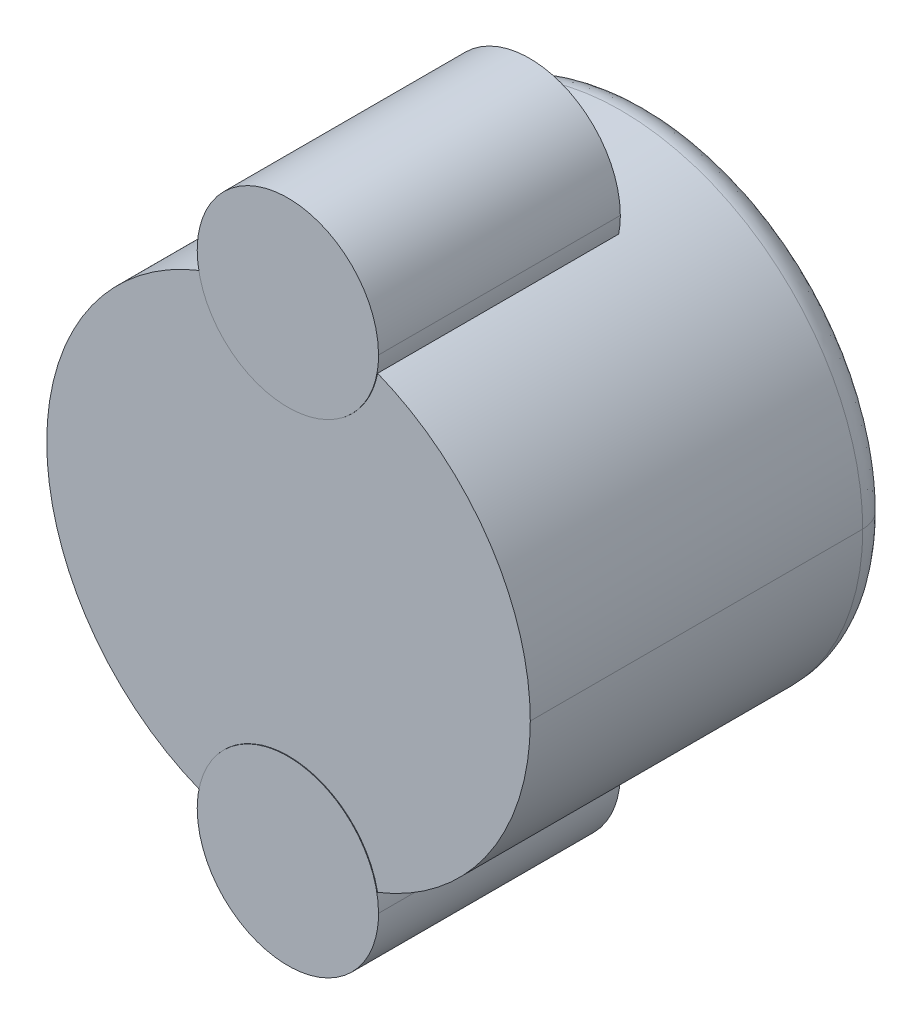
ISO-10303-21;
HEADER;
FILE_DESCRIPTION(('STEP AP214'),'2;1');
FILE_NAME('part.step','',(''),(''),'','','');
FILE_SCHEMA(('AUTOMOTIVE_DESIGN { 1 0 10303 214 1 1 1 1 }'));
ENDSEC;
DATA;
#1=APPLICATION_CONTEXT('core data for automotive mechanical design processes');
#2=APPLICATION_PROTOCOL_DEFINITION('international standard','automotive_design',2000,#1);
#3=PRODUCT_CONTEXT('',#1,'mechanical');
#4=PRODUCT('Part','Part','',(#3));
#5=PRODUCT_RELATED_PRODUCT_CATEGORY('part','',(#4));
#6=PRODUCT_DEFINITION_FORMATION('','',#4);
#7=PRODUCT_DEFINITION_CONTEXT('part definition',#1,'design');
#8=PRODUCT_DEFINITION('design','',#6,#7);
#9=PRODUCT_DEFINITION_SHAPE('','',#8);
#10=(LENGTH_UNIT() NAMED_UNIT(*) SI_UNIT(.MILLI.,.METRE.));
#11=(NAMED_UNIT(*) PLANE_ANGLE_UNIT() SI_UNIT($,.RADIAN.));
#12=(NAMED_UNIT(*) SI_UNIT($,.STERADIAN.) SOLID_ANGLE_UNIT());
#13=UNCERTAINTY_MEASURE_WITH_UNIT(LENGTH_MEASURE(1.E-05),#10,'distance_accuracy_value','');
#14=(GEOMETRIC_REPRESENTATION_CONTEXT(3) GLOBAL_UNCERTAINTY_ASSIGNED_CONTEXT((#13)) GLOBAL_UNIT_ASSIGNED_CONTEXT((#10,
#11,#12)) REPRESENTATION_CONTEXT('',''));
#15=CARTESIAN_POINT('',(0.,0.,0.));
#16=DIRECTION('',(0.,0.,1.));
#17=DIRECTION('',(1.,0.,0.));
#18=AXIS2_PLACEMENT_3D('',#15,#16,#17);
#19=CARTESIAN_POINT('',(-437.422424596463,265.350553242768,-2.98729223072915));
#20=CARTESIAN_POINT('',(-443.542935079947,265.886028525065,-2.98729223072914));
#21=CARTESIAN_POINT('',(-443.542935079947,265.886028525065,3.15659760848395));
#22=CARTESIAN_POINT('',(-443.542935079947,265.886028525065,9.30048744769704));
#23=CARTESIAN_POINT('',(-437.422424596463,265.350553242768,9.30048744769705));
#24=CARTESIAN_POINT('',(-437.422424596463,265.350553242768,-2.98729223072915));
#25=CARTESIAN_POINT('',(-444.078410362244,259.765518041581,-2.98729223072914));
#26=CARTESIAN_POINT('',(-444.078410362244,259.765518041581,3.15659760848395));
#27=CARTESIAN_POINT('',(-444.078410362244,259.765518041581,9.30048744769706));
#28=CARTESIAN_POINT('',(-437.422424596463,265.350553242768,9.30048744769704));
#29=CARTESIAN_POINT('',(-437.422424596463,265.350553242768,-2.98729223072915));
#30=CARTESIAN_POINT('',(-437.95789987876,259.230042759284,-2.98729223072914));
#31=CARTESIAN_POINT('',(-437.95789987876,259.230042759285,3.15659760848395));
#32=CARTESIAN_POINT('',(-437.95789987876,259.230042759284,9.30048744769704));
#33=CARTESIAN_POINT('',(-437.422424596463,265.350553242768,9.30048744769705));
#34=CARTESIAN_POINT('',(-437.422424596463,265.350553242768,-2.98729223072915));
#35=CARTESIAN_POINT('',(-431.837389395276,258.694567476988,-2.98729223072914));
#36=CARTESIAN_POINT('',(-431.837389395276,258.694567476988,3.15659760848395));
#37=CARTESIAN_POINT('',(-431.837389395276,258.694567476988,9.30048744769706));
#38=CARTESIAN_POINT('',(-437.422424596463,265.350553242768,9.30048744769704));
#39=CARTESIAN_POINT('',(-437.422424596463,265.350553242768,-2.98729223072915));
#40=CARTESIAN_POINT('',(-431.301914112979,264.815077960472,-2.98729223072914));
#41=CARTESIAN_POINT('',(-431.301914112979,264.815077960472,3.15659760848395));
#42=CARTESIAN_POINT('',(-431.301914112979,264.815077960472,9.30048744769704));
#43=CARTESIAN_POINT('',(-437.422424596463,265.350553242768,9.30048744769705));
#44=(BOUNDED_SURFACE() B_SPLINE_SURFACE(2,2,((#19,#20,#21,#22,#23),(#24,#25,#26,#27,#28),(#29,
#30,#31,#32,#33),(#34,#35,#36,#37,#38),(#39,#40,#41,#42,#43)),.UNSPECIFIED.,.F.,.F.,
.F.) B_SPLINE_SURFACE_WITH_KNOTS((3,2,3),(3,2,3),(19.3015991833368,28.9523987750053,
38.6031983666737),(-9.65079959166842,0.,9.65079959166842),
.UNSPECIFIED.) GEOMETRIC_REPRESENTATION_ITEM() RATIONAL_B_SPLINE_SURFACE(((1.,0.707106781186548,
1.,0.707106781186548,1.),(0.707106781186548,0.5,0.707106781186548,0.5,0.707106781186548),(1.,
0.707106781186548,1.,0.707106781186548,1.),(0.707106781186548,0.5,0.707106781186548,0.5,
0.707106781186548),(1.,0.707106781186548,1.,0.707106781186548,1.))) REPRESENTATION_ITEM('') SURFACE());
#45=CARTESIAN_POINT('',(-437.422424596463,265.350553242768,-2.98729223072915));
#46=CARTESIAN_POINT('',(-433.953669445613,265.047076490522,-2.98729223072915));
#47=CARTESIAN_POINT('',(-432.17149813393,264.891156704288,0.));
#48=(BOUNDED_CURVE() B_SPLINE_CURVE(2,(#45,#46,#47),.UNSPECIFIED.,.F.,
.F.) B_SPLINE_CURVE_WITH_KNOTS((3,3),(-9.65079959166842,-3.31513902325581),
.UNSPECIFIED.) CURVE() GEOMETRIC_REPRESENTATION_ITEM() RATIONAL_B_SPLINE_CURVE((1.,
0.86999377985046,1.)) REPRESENTATION_ITEM(''));
#49=CARTESIAN_POINT('',(-437.422424596463,265.350553242768,-2.98729223072915));
#50=VERTEX_POINT('',#49);
#51=CARTESIAN_POINT('',(-432.17149813393,264.891156704288,0.));
#52=VERTEX_POINT('',#51);
#53=EDGE_CURVE('E44',#50,#52,#48,.T.);
#54=CARTESIAN_POINT('',(-442.673351058996,265.809949781248,0.));
#55=CARTESIAN_POINT('',(-443.132747597477,260.559023318715,0.));
#56=CARTESIAN_POINT('',(-437.881821134943,260.099626780235,0.));
#57=CARTESIAN_POINT('',(-432.63089467241,259.640230241755,0.));
#58=CARTESIAN_POINT('',(-432.17149813393,264.891156704288,0.));
#59=(BOUNDED_CURVE() B_SPLINE_CURVE(2,(#54,#55,#56,#57,#58),.UNSPECIFIED.,.F.,
.F.) B_SPLINE_CURVE_WITH_KNOTS((3,2,3),(19.3015991833368,28.9523987750053,38.6031983666737),
.UNSPECIFIED.) CURVE() GEOMETRIC_REPRESENTATION_ITEM() RATIONAL_B_SPLINE_CURVE((1.,
0.707106781186548,1.,0.707106781186548,1.)) REPRESENTATION_ITEM(''));
#60=CARTESIAN_POINT('',(-442.673351058996,265.809949781248,0.));
#61=VERTEX_POINT('',#60);
#62=EDGE_CURVE('E277',#61,#52,#59,.T.);
#63=CARTESIAN_POINT('',(-437.422424596463,265.350553242768,-2.98729223072915));
#64=CARTESIAN_POINT('',(-440.891179747313,265.654029995015,-2.98729223072915));
#65=CARTESIAN_POINT('',(-442.673351058996,265.809949781248,0.));
#66=(BOUNDED_CURVE() B_SPLINE_CURVE(2,(#63,#64,#65),.UNSPECIFIED.,.F.,
.F.) B_SPLINE_CURVE_WITH_KNOTS((3,3),(-9.65079959166842,-3.31513902325583),
.UNSPECIFIED.) CURVE() GEOMETRIC_REPRESENTATION_ITEM() RATIONAL_B_SPLINE_CURVE((1.,
0.869993779850461,1.)) REPRESENTATION_ITEM(''));
#67=EDGE_CURVE('E288',#50,#61,#66,.T.);
#68=ORIENTED_EDGE('',*,*,#53,.T.);
#69=ORIENTED_EDGE('',*,*,#62,.F.);
#70=ORIENTED_EDGE('',*,*,#67,.F.);
#71=EDGE_LOOP('',(#68,#69,#70));
#72=FACE_BOUND('',#71,.T.);
#73=ADVANCED_FACE('F16',(#72),#44,.T.);
#74=CARTESIAN_POINT('',(-445.422424596463,265.350553242768,1.));
#75=CARTESIAN_POINT('',(-445.422424596463,257.350553242768,1.));
#76=CARTESIAN_POINT('',(-437.422424596463,257.350553242768,1.));
#77=CARTESIAN_POINT('',(-429.422424596463,257.350553242768,1.));
#78=CARTESIAN_POINT('',(-429.422424596463,265.350553242768,1.));
#79=CARTESIAN_POINT('',(-445.422424596463,265.350553242768,0.));
#80=CARTESIAN_POINT('',(-445.422424596463,257.350553242768,0.));
#81=CARTESIAN_POINT('',(-437.422424596463,257.350553242768,0.));
#82=CARTESIAN_POINT('',(-429.422424596463,257.350553242768,0.));
#83=CARTESIAN_POINT('',(-429.422424596463,265.350553242768,0.));
#84=CARTESIAN_POINT('',(-444.422424596463,265.350553242768,0.));
#85=CARTESIAN_POINT('',(-444.422424596463,258.350553242768,0.));
#86=CARTESIAN_POINT('',(-437.422424596463,258.350553242768,0.));
#87=CARTESIAN_POINT('',(-430.422424596463,258.350553242768,0.));
#88=CARTESIAN_POINT('',(-430.422424596463,265.350553242768,0.));
#89=(BOUNDED_SURFACE() B_SPLINE_SURFACE(2,2,((#74,#75,#76,#77,#78),(#79,#80,#81,#82,#83),(#84,
#85,#86,#87,#88)),.UNSPECIFIED.,.F.,.F.,.F.) B_SPLINE_SURFACE_WITH_KNOTS((3,3),(3,2,3),(0.,
1.57079633225259),(21.9905929771512,32.9858894657268,43.9811859543023),
.UNSPECIFIED.) GEOMETRIC_REPRESENTATION_ITEM() RATIONAL_B_SPLINE_SURFACE(((1.,0.707106781186548,
1.,0.707106781186548,1.),(0.707106781186513,0.499999999999976,0.707106781186513,
0.499999999999976,0.707106781186513),(1.,0.707106781186548,1.,0.707106781186548,1.))) REPRESENTATION_ITEM('') SURFACE());
#90=CARTESIAN_POINT('',(-445.422424596463,265.350553242768,1.));
#91=CARTESIAN_POINT('',(-445.422424596463,265.350553242768,0.));
#92=CARTESIAN_POINT('',(-444.422424596463,265.350553242768,0.));
#93=(BOUNDED_CURVE() B_SPLINE_CURVE(2,(#90,#91,#92),.UNSPECIFIED.,.F.,
.F.) B_SPLINE_CURVE_WITH_KNOTS((3,3),(0.,1.57079633225259),
.UNSPECIFIED.) CURVE() GEOMETRIC_REPRESENTATION_ITEM() RATIONAL_B_SPLINE_CURVE((1.,
0.707106781186513,1.)) REPRESENTATION_ITEM(''));
#94=CARTESIAN_POINT('',(-445.422424596463,265.350553242768,1.));
#95=VERTEX_POINT('',#94);
#96=CARTESIAN_POINT('',(-444.422424596463,265.350553242768,0.));
#97=VERTEX_POINT('',#96);
#98=EDGE_CURVE('E296',#95,#97,#93,.T.);
#99=CARTESIAN_POINT('',(-444.422424596463,265.350553242768,0.));
#100=CARTESIAN_POINT('',(-444.422424596463,258.350553242768,0.));
#101=CARTESIAN_POINT('',(-437.422424596463,258.350553242768,0.));
#102=CARTESIAN_POINT('',(-430.422424596463,258.350553242768,0.));
#103=CARTESIAN_POINT('',(-430.422424596463,265.350553242768,0.));
#104=(BOUNDED_CURVE() B_SPLINE_CURVE(2,(#99,#100,#101,#102,#103),.UNSPECIFIED.,.F.,
.F.) B_SPLINE_CURVE_WITH_KNOTS((3,2,3),(21.9905929771512,32.9858894657268,43.9811859543023),
.UNSPECIFIED.) CURVE() GEOMETRIC_REPRESENTATION_ITEM() RATIONAL_B_SPLINE_CURVE((1.,
0.707106781186548,1.,0.707106781186548,1.)) REPRESENTATION_ITEM(''));
#105=CARTESIAN_POINT('',(-430.422424596463,265.350553242768,0.));
#106=VERTEX_POINT('',#105);
#107=EDGE_CURVE('E201',#97,#106,#104,.T.);
#108=CARTESIAN_POINT('',(-429.422424596463,265.350553242768,1.));
#109=CARTESIAN_POINT('',(-429.422424596463,265.350553242768,0.));
#110=CARTESIAN_POINT('',(-430.422424596463,265.350553242768,0.));
#111=(BOUNDED_CURVE() B_SPLINE_CURVE(2,(#108,#109,#110),.UNSPECIFIED.,.F.,
.F.) B_SPLINE_CURVE_WITH_KNOTS((3,3),(0.,1.57079633225259),
.UNSPECIFIED.) CURVE() GEOMETRIC_REPRESENTATION_ITEM() RATIONAL_B_SPLINE_CURVE((1.,
0.707106781186513,1.)) REPRESENTATION_ITEM(''));
#112=CARTESIAN_POINT('',(-429.422424596463,265.350553242768,1.));
#113=VERTEX_POINT('',#112);
#114=EDGE_CURVE('E286',#113,#106,#111,.T.);
#115=CARTESIAN_POINT('',(-445.422424596463,265.350553242768,1.));
#116=CARTESIAN_POINT('',(-445.422424596463,257.350553242769,1.));
#117=CARTESIAN_POINT('',(-437.422424596463,257.350553242768,1.));
#118=CARTESIAN_POINT('',(-429.422424596463,257.350553242768,1.));
#119=CARTESIAN_POINT('',(-429.422424596463,265.350553242768,1.));
#120=(BOUNDED_CURVE() B_SPLINE_CURVE(2,(#115,#116,#117,#118,#119),.UNSPECIFIED.,.F.,
.F.) B_SPLINE_CURVE_WITH_KNOTS((3,2,3),(21.9905929771511,32.9858894657267,43.9811859543023),
.UNSPECIFIED.) CURVE() GEOMETRIC_REPRESENTATION_ITEM() RATIONAL_B_SPLINE_CURVE((1.,
0.707106781186546,1.,0.707106781186546,1.)) REPRESENTATION_ITEM(''));
#121=EDGE_CURVE('E10',#95,#113,#120,.T.);
#122=ORIENTED_EDGE('',*,*,#98,.T.);
#123=ORIENTED_EDGE('',*,*,#107,.T.);
#124=ORIENTED_EDGE('',*,*,#114,.F.);
#125=ORIENTED_EDGE('',*,*,#121,.F.);
#126=EDGE_LOOP('',(#122,#123,#124,#125));
#127=FACE_BOUND('',#126,.T.);
#128=ADVANCED_FACE('F497',(#127),#89,.T.);
#129=CARTESIAN_POINT('',(-437.422424596463,265.350553242768,6.));
#130=DIRECTION('',(0.,0.,1.));
#131=DIRECTION('',(1.,0.,0.));
#132=AXIS2_PLACEMENT_3D('',#129,#130,#131);
#133=CYLINDRICAL_SURFACE('',#132,8.);
#134=ORIENTED_EDGE('',*,*,#121,.T.);
#135=CARTESIAN_POINT('',(-429.422424596463,265.350553242768,1.));
#136=CARTESIAN_POINT('',(-429.422424596463,265.350553242768,12.));
#137=(BOUNDED_CURVE() B_SPLINE_CURVE(1,(#135,#136),.UNSPECIFIED.,.F.,
.F.) B_SPLINE_CURVE_WITH_KNOTS((2,2),(1.,12.),
.UNSPECIFIED.) CURVE() GEOMETRIC_REPRESENTATION_ITEM() RATIONAL_B_SPLINE_CURVE((1.,1.)) REPRESENTATION_ITEM(''));
#138=CARTESIAN_POINT('',(-429.422424596463,265.350553242768,12.));
#139=VERTEX_POINT('',#138);
#140=EDGE_CURVE('E190',#113,#139,#137,.T.);
#141=ORIENTED_EDGE('',*,*,#140,.T.);
#142=CARTESIAN_POINT('',(-434.475630787828,257.91305324281,12.));
#143=CARTESIAN_POINT('',(-429.422424596463,259.915171793203,12.));
#144=CARTESIAN_POINT('',(-429.422424596463,265.350553242768,12.));
#145=(BOUNDED_CURVE() B_SPLINE_CURVE(2,(#142,#143,#144),.UNSPECIFIED.,.F.,
.F.) B_SPLINE_CURVE_WITH_KNOTS((3,3),(40.842869749062,50.2654824574367),
.UNSPECIFIED.) CURVE() GEOMETRIC_REPRESENTATION_ITEM() RATIONAL_B_SPLINE_CURVE((1.,
0.827148483066808,1.)) REPRESENTATION_ITEM(''));
#146=CARTESIAN_POINT('',(-434.475630787828,257.91305324281,12.));
#147=VERTEX_POINT('',#146);
#148=EDGE_CURVE('E82',#147,#139,#145,.T.);
#149=ORIENTED_EDGE('',*,*,#148,.F.);
#150=CARTESIAN_POINT('',(-434.475630787828,257.913053242809,4.02131854360457));
#151=CARTESIAN_POINT('',(-434.475630787828,257.91305324281,12.));
#152=(BOUNDED_CURVE() B_SPLINE_CURVE(1,(#150,#151),.UNSPECIFIED.,.F.,
.F.) B_SPLINE_CURVE_WITH_KNOTS((2,2),(0.,7.97868145639543),
.UNSPECIFIED.) CURVE() GEOMETRIC_REPRESENTATION_ITEM() RATIONAL_B_SPLINE_CURVE((1.,1.)) REPRESENTATION_ITEM(''));
#153=CARTESIAN_POINT('',(-434.475630787828,257.913053242809,4.02131854360457));
#154=VERTEX_POINT('',#153);
#155=EDGE_CURVE('E230',#154,#147,#152,.T.);
#156=ORIENTED_EDGE('',*,*,#155,.F.);
#157=CARTESIAN_POINT('',(-434.475630787828,257.913053242809,4.02131854360457));
#158=CARTESIAN_POINT('',(-437.422424596343,256.745511225963,4.02131854360458));
#159=CARTESIAN_POINT('',(-440.369218404891,257.913053242727,4.02131854360457));
#160=(BOUNDED_CURVE() B_SPLINE_CURVE(2,(#157,#158,#159),.UNSPECIFIED.,.F.,
.F.) B_SPLINE_CURVE_WITH_KNOTS((3,3),(-40.8428697490627,-34.5553539373133),
.UNSPECIFIED.) CURVE() GEOMETRIC_REPRESENTATION_ITEM() RATIONAL_B_SPLINE_CURVE((1.,0.9296875,1.)) REPRESENTATION_ITEM(''));
#161=CARTESIAN_POINT('',(-440.369218404891,257.913053242727,4.02131854360457));
#162=VERTEX_POINT('',#161);
#163=EDGE_CURVE('E306',#154,#162,#160,.T.);
#164=ORIENTED_EDGE('',*,*,#163,.T.);
#165=CARTESIAN_POINT('',(-440.369218404891,257.913053242727,12.));
#166=CARTESIAN_POINT('',(-440.369218404891,257.913053242727,4.02131854360457));
#167=(BOUNDED_CURVE() B_SPLINE_CURVE(1,(#165,#166),.UNSPECIFIED.,.F.,
.F.) B_SPLINE_CURVE_WITH_KNOTS((2,2),(-7.97868145639543,0.),
.UNSPECIFIED.) CURVE() GEOMETRIC_REPRESENTATION_ITEM() RATIONAL_B_SPLINE_CURVE((1.,1.)) REPRESENTATION_ITEM(''));
#168=CARTESIAN_POINT('',(-440.369218404891,257.913053242727,12.));
#169=VERTEX_POINT('',#168);
#170=EDGE_CURVE('E221',#169,#162,#167,.T.);
#171=ORIENTED_EDGE('',*,*,#170,.F.);
#172=CARTESIAN_POINT('',(-445.422424596463,265.350553242768,12.));
#173=CARTESIAN_POINT('',(-445.422424596463,259.91517179304,12.));
#174=CARTESIAN_POINT('',(-440.369218404891,257.913053242727,12.));
#175=(BOUNDED_CURVE() B_SPLINE_CURVE(2,(#172,#173,#174),.UNSPECIFIED.,.F.,
.F.) B_SPLINE_CURVE_WITH_KNOTS((3,3),(25.1327412287183,34.5553539373142),
.UNSPECIFIED.) CURVE() GEOMETRIC_REPRESENTATION_ITEM() RATIONAL_B_SPLINE_CURVE((1.,
0.827148483058949,1.)) REPRESENTATION_ITEM(''));
#176=CARTESIAN_POINT('',(-445.422424596463,265.350553242768,12.));
#177=VERTEX_POINT('',#176);
#178=EDGE_CURVE('E67',#177,#169,#175,.T.);
#179=ORIENTED_EDGE('',*,*,#178,.F.);
#180=CARTESIAN_POINT('',(-445.422424596463,265.350553242768,1.));
#181=CARTESIAN_POINT('',(-445.422424596463,265.350553242768,12.));
#182=(BOUNDED_CURVE() B_SPLINE_CURVE(1,(#180,#181),.UNSPECIFIED.,.F.,
.F.) B_SPLINE_CURVE_WITH_KNOTS((2,2),(1.,12.),
.UNSPECIFIED.) CURVE() GEOMETRIC_REPRESENTATION_ITEM() RATIONAL_B_SPLINE_CURVE((1.,1.)) REPRESENTATION_ITEM(''));
#183=EDGE_CURVE('E305',#95,#177,#182,.T.);
#184=ORIENTED_EDGE('',*,*,#183,.F.);
#185=EDGE_LOOP('',(#134,#141,#149,#156,#164,#171,#179,#184));
#186=FACE_BOUND('',#185,.T.);
#187=ADVANCED_FACE('F476',(#186),#133,.T.);
#188=CARTESIAN_POINT('',(-437.422424596351,257.350553242768,8.02131854360457));
#189=DIRECTION('',(0.,0.,1.));
#190=DIRECTION('',(1.,0.,0.));
#191=AXIS2_PLACEMENT_3D('',#188,#189,#190);
#192=CYLINDRICAL_SURFACE('',#191,3.00000000000006);
#193=CARTESIAN_POINT('',(-440.422424596351,257.350553242768,4.02131854360457));
#194=CARTESIAN_POINT('',(-440.422424596351,254.350553242768,4.02131854360457));
#195=CARTESIAN_POINT('',(-437.422424596351,254.350553242768,4.02131854360457));
#196=CARTESIAN_POINT('',(-434.422424596351,254.350553242768,4.02131854360457));
#197=CARTESIAN_POINT('',(-434.422424596351,257.350553242768,4.02131854360457));
#198=(BOUNDED_CURVE() B_SPLINE_CURVE(2,(#193,#194,#195,#196,#197),.UNSPECIFIED.,.F.,
.F.) B_SPLINE_CURVE_WITH_KNOTS((3,2,3),(9.42477796076938,14.1371669411541,18.8495559215388),
.UNSPECIFIED.) CURVE() GEOMETRIC_REPRESENTATION_ITEM() RATIONAL_B_SPLINE_CURVE((1.,
0.707106781186548,1.,0.707106781186548,1.)) REPRESENTATION_ITEM(''));
#199=CARTESIAN_POINT('',(-440.422424596351,257.350553242768,4.02131854360457));
#200=VERTEX_POINT('',#199);
#201=CARTESIAN_POINT('',(-434.422424596351,257.350553242768,4.02131854360457));
#202=VERTEX_POINT('',#201);
#203=EDGE_CURVE('E220',#200,#202,#198,.T.);
#204=ORIENTED_EDGE('',*,*,#203,.T.);
#205=CARTESIAN_POINT('',(-434.422424596351,257.350553242768,4.02131854360457));
#206=CARTESIAN_POINT('',(-434.422424596351,257.350553242768,12.0213185436046));
#207=(BOUNDED_CURVE() B_SPLINE_CURVE(1,(#205,#206),.UNSPECIFIED.,.F.,
.F.) B_SPLINE_CURVE_WITH_KNOTS((2,2),(0.,8.),
.UNSPECIFIED.) CURVE() GEOMETRIC_REPRESENTATION_ITEM() RATIONAL_B_SPLINE_CURVE((1.,1.)) REPRESENTATION_ITEM(''));
#208=CARTESIAN_POINT('',(-434.422424596351,257.350553242768,12.0213185436046));
#209=VERTEX_POINT('',#208);
#210=EDGE_CURVE('E231',#202,#209,#207,.T.);
#211=ORIENTED_EDGE('',*,*,#210,.T.);
#212=CARTESIAN_POINT('',(-440.422424596351,257.350553242768,12.0213185436046));
#213=CARTESIAN_POINT('',(-440.422424596351,254.350553242768,12.0213185436046));
#214=CARTESIAN_POINT('',(-437.422424596351,254.350553242768,12.0213185436046));
#215=CARTESIAN_POINT('',(-434.422424596351,254.350553242768,12.0213185436046));
#216=CARTESIAN_POINT('',(-434.422424596351,257.350553242768,12.0213185436046));
#217=(BOUNDED_CURVE() B_SPLINE_CURVE(2,(#212,#213,#214,#215,#216),.UNSPECIFIED.,.F.,
.F.) B_SPLINE_CURVE_WITH_KNOTS((3,2,3),(9.42477796076938,14.1371669411541,18.8495559215388),
.UNSPECIFIED.) CURVE() GEOMETRIC_REPRESENTATION_ITEM() RATIONAL_B_SPLINE_CURVE((1.,
0.707106781186548,1.,0.707106781186548,1.)) REPRESENTATION_ITEM(''));
#218=CARTESIAN_POINT('',(-440.422424596351,257.350553242768,12.0213185436046));
#219=VERTEX_POINT('',#218);
#220=EDGE_CURVE('E297',#219,#209,#217,.T.);
#221=ORIENTED_EDGE('',*,*,#220,.F.);
#222=CARTESIAN_POINT('',(-440.422424596351,257.350553242768,4.02131854360457));
#223=CARTESIAN_POINT('',(-440.422424596351,257.350553242768,12.0213185436046));
#224=(BOUNDED_CURVE() B_SPLINE_CURVE(1,(#222,#223),.UNSPECIFIED.,.F.,
.F.) B_SPLINE_CURVE_WITH_KNOTS((2,2),(0.,8.),
.UNSPECIFIED.) CURVE() GEOMETRIC_REPRESENTATION_ITEM() RATIONAL_B_SPLINE_CURVE((1.,1.)) REPRESENTATION_ITEM(''));
#225=EDGE_CURVE('E157',#200,#219,#224,.T.);
#226=ORIENTED_EDGE('',*,*,#225,.F.);
#227=EDGE_LOOP('',(#204,#211,#221,#226));
#228=FACE_BOUND('',#227,.T.);
#229=ADVANCED_FACE('F551',(#228),#192,.T.);
#230=CARTESIAN_POINT('',(-437.422424596351,273.350553242768,8.02131854360457));
#231=DIRECTION('',(0.,0.,1.));
#232=DIRECTION('',(1.,0.,0.));
#233=AXIS2_PLACEMENT_3D('',#230,#231,#232);
#234=CYLINDRICAL_SURFACE('',#233,3.00000000000006);
#235=CARTESIAN_POINT('',(-440.422424596351,273.350553242768,4.02131854360457));
#236=CARTESIAN_POINT('',(-440.422424596351,273.066786888291,4.02131854360457));
#237=CARTESIAN_POINT('',(-440.369218404891,272.78805324281,4.02131854360457));
#238=(BOUNDED_CURVE() B_SPLINE_CURVE(2,(#235,#236,#237),.UNSPECIFIED.,.F.,
.F.) B_SPLINE_CURVE_WITH_KNOTS((3,3),(9.42477796076938,10.0313816031907),
.UNSPECIFIED.) CURVE() GEOMETRIC_REPRESENTATION_ITEM() RATIONAL_B_SPLINE_CURVE((1.,
0.995556277376243,1.)) REPRESENTATION_ITEM(''));
#239=CARTESIAN_POINT('',(-440.422424596351,273.350553242768,4.02131854360457));
#240=VERTEX_POINT('',#239);
#241=CARTESIAN_POINT('',(-440.369218404891,272.78805324281,4.02131854360457));
#242=VERTEX_POINT('',#241);
#243=EDGE_CURVE('E260',#240,#242,#238,.T.);
#244=ORIENTED_EDGE('',*,*,#243,.T.);
#245=CARTESIAN_POINT('',(-440.369218404891,272.78805324281,4.02131854360457));
#246=CARTESIAN_POINT('',(-440.369218404891,272.788053242809,12.));
#247=(BOUNDED_CURVE() B_SPLINE_CURVE(1,(#245,#246),.UNSPECIFIED.,.F.,
.F.) B_SPLINE_CURVE_WITH_KNOTS((2,2),(0.,7.97868145639543),
.UNSPECIFIED.) CURVE() GEOMETRIC_REPRESENTATION_ITEM() RATIONAL_B_SPLINE_CURVE((1.,1.)) REPRESENTATION_ITEM(''));
#248=CARTESIAN_POINT('',(-440.369218404891,272.788053242809,12.));
#249=VERTEX_POINT('',#248);
#250=EDGE_CURVE('E354',#242,#249,#247,.T.);
#251=ORIENTED_EDGE('',*,*,#250,.T.);
#252=CARTESIAN_POINT('',(-440.369218404891,272.788053242809,12.));
#253=CARTESIAN_POINT('',(-439.903935171999,270.350553242803,12.));
#254=CARTESIAN_POINT('',(-437.422424596393,270.350553242768,12.));
#255=CARTESIAN_POINT('',(-434.940914020788,270.350553242734,12.));
#256=CARTESIAN_POINT('',(-434.475630787828,272.788053242727,12.));
#257=(BOUNDED_CURVE() B_SPLINE_CURVE(2,(#252,#253,#254,#255,#256),.UNSPECIFIED.,.F.,
.F.) B_SPLINE_CURVE_WITH_KNOTS((3,2,3),(10.0313816031908,14.1371669411106,18.2429522790304),
.UNSPECIFIED.) CURVE() GEOMETRIC_REPRESENTATION_ITEM() RATIONAL_B_SPLINE_CURVE((1.,
0.770551750371121,1.,0.770551750371121,1.)) REPRESENTATION_ITEM(''));
#258=CARTESIAN_POINT('',(-434.475630787828,272.788053242727,12.));
#259=VERTEX_POINT('',#258);
#260=EDGE_CURVE('E30',#249,#259,#257,.T.);
#261=ORIENTED_EDGE('',*,*,#260,.T.);
#262=CARTESIAN_POINT('',(-434.475630787828,272.788053242727,12.));
#263=CARTESIAN_POINT('',(-434.475630787828,272.788053242727,4.02131854360457));
#264=(BOUNDED_CURVE() B_SPLINE_CURVE(1,(#262,#263),.UNSPECIFIED.,.F.,
.F.) B_SPLINE_CURVE_WITH_KNOTS((2,2),(-12.,-4.02131854360457),
.UNSPECIFIED.) CURVE() GEOMETRIC_REPRESENTATION_ITEM() RATIONAL_B_SPLINE_CURVE((1.,1.)) REPRESENTATION_ITEM(''));
#265=CARTESIAN_POINT('',(-434.475630787828,272.788053242727,4.02131854360457));
#266=VERTEX_POINT('',#265);
#267=EDGE_CURVE('E191',#259,#266,#264,.T.);
#268=ORIENTED_EDGE('',*,*,#267,.T.);
#269=CARTESIAN_POINT('',(-434.475630787828,272.788053242727,4.02131854360457));
#270=CARTESIAN_POINT('',(-434.422424596351,273.066786888249,4.02131854360457));
#271=CARTESIAN_POINT('',(-434.422424596351,273.350553242768,4.02131854360457));
#272=(BOUNDED_CURVE() B_SPLINE_CURVE(2,(#269,#270,#271),.UNSPECIFIED.,.F.,
.F.) B_SPLINE_CURVE_WITH_KNOTS((3,3),(18.2429522790303,18.8495559215388),
.UNSPECIFIED.) CURVE() GEOMETRIC_REPRESENTATION_ITEM() RATIONAL_B_SPLINE_CURVE((1.,
0.995556277374924,1.)) REPRESENTATION_ITEM(''));
#273=CARTESIAN_POINT('',(-434.422424596351,273.350553242768,4.02131854360457));
#274=VERTEX_POINT('',#273);
#275=EDGE_CURVE('E252',#266,#274,#272,.T.);
#276=ORIENTED_EDGE('',*,*,#275,.T.);
#277=CARTESIAN_POINT('',(-434.422424596351,273.350553242768,4.02131854360457));
#278=CARTESIAN_POINT('',(-434.422424596351,273.350553242768,12.0213185436046));
#279=(BOUNDED_CURVE() B_SPLINE_CURVE(1,(#277,#278),.UNSPECIFIED.,.F.,
.F.) B_SPLINE_CURVE_WITH_KNOTS((2,2),(0.,8.),
.UNSPECIFIED.) CURVE() GEOMETRIC_REPRESENTATION_ITEM() RATIONAL_B_SPLINE_CURVE((1.,1.)) REPRESENTATION_ITEM(''));
#280=CARTESIAN_POINT('',(-434.422424596351,273.350553242768,12.0213185436046));
#281=VERTEX_POINT('',#280);
#282=EDGE_CURVE('E21',#274,#281,#279,.T.);
#283=ORIENTED_EDGE('',*,*,#282,.T.);
#284=CARTESIAN_POINT('',(-440.422424596351,273.350553242768,12.0213185436046));
#285=CARTESIAN_POINT('',(-440.422424596351,270.350553242768,12.0213185436046));
#286=CARTESIAN_POINT('',(-437.422424596351,270.350553242768,12.0213185436046));
#287=CARTESIAN_POINT('',(-434.422424596351,270.350553242768,12.0213185436046));
#288=CARTESIAN_POINT('',(-434.422424596351,273.350553242768,12.0213185436046));
#289=(BOUNDED_CURVE() B_SPLINE_CURVE(2,(#284,#285,#286,#287,#288),.UNSPECIFIED.,.F.,
.F.) B_SPLINE_CURVE_WITH_KNOTS((3,2,3),(9.42477796076938,14.1371669411541,18.8495559215388),
.UNSPECIFIED.) CURVE() GEOMETRIC_REPRESENTATION_ITEM() RATIONAL_B_SPLINE_CURVE((1.,
0.707106781186548,1.,0.707106781186548,1.)) REPRESENTATION_ITEM(''));
#290=CARTESIAN_POINT('',(-440.422424596351,273.350553242768,12.0213185436046));
#291=VERTEX_POINT('',#290);
#292=EDGE_CURVE('E147',#291,#281,#289,.T.);
#293=ORIENTED_EDGE('',*,*,#292,.F.);
#294=CARTESIAN_POINT('',(-440.422424596351,273.350553242768,4.02131854360457));
#295=CARTESIAN_POINT('',(-440.422424596351,273.350553242768,12.0213185436046));
#296=(BOUNDED_CURVE() B_SPLINE_CURVE(1,(#294,#295),.UNSPECIFIED.,.F.,
.F.) B_SPLINE_CURVE_WITH_KNOTS((2,2),(0.,8.),
.UNSPECIFIED.) CURVE() GEOMETRIC_REPRESENTATION_ITEM() RATIONAL_B_SPLINE_CURVE((1.,1.)) REPRESENTATION_ITEM(''));
#297=EDGE_CURVE('E152',#240,#291,#296,.T.);
#298=ORIENTED_EDGE('',*,*,#297,.F.);
#299=EDGE_LOOP('',(#244,#251,#261,#268,#276,#283,#293,#298));
#300=FACE_BOUND('',#299,.T.);
#301=ADVANCED_FACE('F150',(#300),#234,.T.);
#302=CARTESIAN_POINT('',(-447.422424596463,255.350553242768,12.));
#303=DIRECTION('',(0.,0.,1.));
#304=DIRECTION('',(1.,0.,0.));
#305=AXIS2_PLACEMENT_3D('',#302,#303,#304);
#306=PLANE('',#305);
#307=CARTESIAN_POINT('',(-440.369218404891,272.788053242809,12.));
#308=CARTESIAN_POINT('',(-445.422424596463,270.785934692497,12.));
#309=CARTESIAN_POINT('',(-445.422424596463,265.350553242768,12.));
#310=(BOUNDED_CURVE() B_SPLINE_CURVE(2,(#307,#308,#309),.UNSPECIFIED.,.F.,
.F.) B_SPLINE_CURVE_WITH_KNOTS((3,3),(15.7101285201227,25.1327412287183),
.UNSPECIFIED.) CURVE() GEOMETRIC_REPRESENTATION_ITEM() RATIONAL_B_SPLINE_CURVE((1.,
0.827148483058957,1.)) REPRESENTATION_ITEM(''));
#311=EDGE_CURVE('E178',#249,#177,#310,.T.);
#312=ORIENTED_EDGE('',*,*,#311,.T.);
#313=ORIENTED_EDGE('',*,*,#178,.T.);
#314=CARTESIAN_POINT('',(-434.475630787828,257.91305324281,12.));
#315=CARTESIAN_POINT('',(-434.940914020788,260.350553242803,12.));
#316=CARTESIAN_POINT('',(-437.422424596393,260.350553242769,12.));
#317=CARTESIAN_POINT('',(-439.903935171999,260.350553242734,12.));
#318=CARTESIAN_POINT('',(-440.369218404891,257.913053242727,12.));
#319=(BOUNDED_CURVE() B_SPLINE_CURVE(2,(#314,#315,#316,#317,#318),.UNSPECIFIED.,.F.,
.F.) B_SPLINE_CURVE_WITH_KNOTS((3,2,3),(0.60660364250845,4.71238898042822,8.81817431834799),
.UNSPECIFIED.) CURVE() GEOMETRIC_REPRESENTATION_ITEM() RATIONAL_B_SPLINE_CURVE((1.,
0.770551750371093,1.,0.770551750371093,1.)) REPRESENTATION_ITEM(''));
#320=EDGE_CURVE('E261',#147,#169,#319,.T.);
#321=ORIENTED_EDGE('',*,*,#320,.F.);
#322=ORIENTED_EDGE('',*,*,#148,.T.);
#323=CARTESIAN_POINT('',(-429.422424596463,265.350553242768,12.));
#324=CARTESIAN_POINT('',(-429.422424596463,270.785934692333,12.));
#325=CARTESIAN_POINT('',(-434.475630787828,272.788053242727,12.));
#326=(BOUNDED_CURVE() B_SPLINE_CURVE(2,(#323,#324,#325),.UNSPECIFIED.,.F.,
.F.) B_SPLINE_CURVE_WITH_KNOTS((3,3),(0.,9.42261270837458),
.UNSPECIFIED.) CURVE() GEOMETRIC_REPRESENTATION_ITEM() RATIONAL_B_SPLINE_CURVE((1.,
0.82714848306681,1.)) REPRESENTATION_ITEM(''));
#327=EDGE_CURVE('E182',#139,#259,#326,.T.);
#328=ORIENTED_EDGE('',*,*,#327,.T.);
#329=ORIENTED_EDGE('',*,*,#260,.F.);
#330=EDGE_LOOP('',(#312,#313,#321,#322,#328,#329));
#331=FACE_BOUND('',#330,.T.);
#332=ADVANCED_FACE('F483',(#331),#306,.T.);
#333=CARTESIAN_POINT('',(-437.422424596463,265.350553242768,-2.98729223072915));
#334=CARTESIAN_POINT('',(-431.301914112979,264.815077960472,-2.98729223072914));
#335=CARTESIAN_POINT('',(-431.301914112979,264.815077960472,3.15659760848395));
#336=CARTESIAN_POINT('',(-431.301914112979,264.815077960472,9.30048744769704));
#337=CARTESIAN_POINT('',(-437.422424596463,265.350553242768,9.30048744769705));
#338=CARTESIAN_POINT('',(-437.422424596463,265.350553242768,-2.98729223072915));
#339=CARTESIAN_POINT('',(-430.766438830683,270.935588443956,-2.98729223072914));
#340=CARTESIAN_POINT('',(-430.766438830683,270.935588443956,3.15659760848395));
#341=CARTESIAN_POINT('',(-430.766438830683,270.935588443956,9.30048744769706));
#342=CARTESIAN_POINT('',(-437.422424596463,265.350553242768,9.30048744769704));
#343=CARTESIAN_POINT('',(-437.422424596463,265.350553242768,-2.98729223072915));
#344=CARTESIAN_POINT('',(-436.886949314167,271.471063726252,-2.98729223072914));
#345=CARTESIAN_POINT('',(-436.886949314167,271.471063726252,3.15659760848395));
#346=CARTESIAN_POINT('',(-436.886949314167,271.471063726252,9.30048744769704));
#347=CARTESIAN_POINT('',(-437.422424596463,265.350553242768,9.30048744769705));
#348=CARTESIAN_POINT('',(-437.422424596463,265.350553242768,-2.98729223072915));
#349=CARTESIAN_POINT('',(-443.007459797651,272.006539008549,-2.98729223072914));
#350=CARTESIAN_POINT('',(-443.007459797651,272.006539008549,3.15659760848395));
#351=CARTESIAN_POINT('',(-443.007459797651,272.006539008549,9.30048744769706));
#352=CARTESIAN_POINT('',(-437.422424596463,265.350553242768,9.30048744769704));
#353=CARTESIAN_POINT('',(-437.422424596463,265.350553242768,-2.98729223072915));
#354=CARTESIAN_POINT('',(-443.542935079947,265.886028525065,-2.98729223072914));
#355=CARTESIAN_POINT('',(-443.542935079947,265.886028525065,3.15659760848395));
#356=CARTESIAN_POINT('',(-443.542935079947,265.886028525065,9.30048744769704));
#357=CARTESIAN_POINT('',(-437.422424596463,265.350553242768,9.30048744769705));
#358=(BOUNDED_SURFACE() B_SPLINE_SURFACE(2,2,((#333,#334,#335,#336,#337),(#338,#339,#340,#341,
#342),(#343,#344,#345,#346,#347),(#348,#349,#350,#351,#352),(#353,#354,#355,#356,#357)),
.UNSPECIFIED.,.F.,.F.,.F.) B_SPLINE_SURFACE_WITH_KNOTS((3,2,3),(3,2,3),(0.,9.65079959166842,
19.3015991833368),(-9.65079959166842,0.,9.65079959166842),
.UNSPECIFIED.) GEOMETRIC_REPRESENTATION_ITEM() RATIONAL_B_SPLINE_SURFACE(((1.,0.707106781186548,
1.,0.707106781186548,1.),(0.707106781186548,0.5,0.707106781186548,0.5,0.707106781186548),(1.,
0.707106781186548,1.,0.707106781186548,1.),(0.707106781186548,0.5,0.707106781186548,0.5,
0.707106781186548),(1.,0.707106781186548,1.,0.707106781186548,1.))) REPRESENTATION_ITEM('') SURFACE());
#359=CARTESIAN_POINT('',(-432.17149813393,264.891156704288,0.));
#360=CARTESIAN_POINT('',(-431.71210159545,270.142083166822,0.));
#361=CARTESIAN_POINT('',(-436.963028057983,270.601479705302,0.));
#362=CARTESIAN_POINT('',(-442.213954520516,271.060876243782,0.));
#363=CARTESIAN_POINT('',(-442.673351058996,265.809949781248,0.));
#364=(BOUNDED_CURVE() B_SPLINE_CURVE(2,(#359,#360,#361,#362,#363),.UNSPECIFIED.,.F.,
.F.) B_SPLINE_CURVE_WITH_KNOTS((3,2,3),(0.,9.65079959166842,19.3015991833368),
.UNSPECIFIED.) CURVE() GEOMETRIC_REPRESENTATION_ITEM() RATIONAL_B_SPLINE_CURVE((1.,
0.707106781186548,1.,0.707106781186548,1.)) REPRESENTATION_ITEM(''));
#365=EDGE_CURVE('E287',#52,#61,#364,.T.);
#366=ORIENTED_EDGE('',*,*,#67,.T.);
#367=ORIENTED_EDGE('',*,*,#365,.F.);
#368=ORIENTED_EDGE('',*,*,#53,.F.);
#369=EDGE_LOOP('',(#366,#367,#368));
#370=FACE_BOUND('',#369,.T.);
#371=ADVANCED_FACE('F510',(#370),#358,.T.);
#372=CARTESIAN_POINT('',(-429.422424596463,265.350553242768,1.));
#373=CARTESIAN_POINT('',(-429.422424596463,273.350553242768,1.));
#374=CARTESIAN_POINT('',(-437.422424596463,273.350553242768,1.));
#375=CARTESIAN_POINT('',(-445.422424596463,273.350553242768,1.));
#376=CARTESIAN_POINT('',(-445.422424596463,265.350553242768,1.));
#377=CARTESIAN_POINT('',(-429.422424596463,265.350553242768,0.));
#378=CARTESIAN_POINT('',(-429.422424596463,273.350553242768,0.));
#379=CARTESIAN_POINT('',(-437.422424596463,273.350553242768,0.));
#380=CARTESIAN_POINT('',(-445.422424596463,273.350553242768,0.));
#381=CARTESIAN_POINT('',(-445.422424596463,265.350553242768,0.));
#382=CARTESIAN_POINT('',(-430.422424596463,265.350553242768,0.));
#383=CARTESIAN_POINT('',(-430.422424596463,272.350553242768,0.));
#384=CARTESIAN_POINT('',(-437.422424596463,272.350553242768,0.));
#385=CARTESIAN_POINT('',(-444.422424596463,272.350553242768,0.));
#386=CARTESIAN_POINT('',(-444.422424596463,265.350553242768,0.));
#387=(BOUNDED_SURFACE() B_SPLINE_SURFACE(2,2,((#372,#373,#374,#375,#376),(#377,#378,#379,#380,
#381),(#382,#383,#384,#385,#386)),.UNSPECIFIED.,.F.,.F.,.F.) B_SPLINE_SURFACE_WITH_KNOTS((3,3),
(3,2,3),(0.,1.57079633225259),(0.,10.9952964885756,21.9905929771512),
.UNSPECIFIED.) GEOMETRIC_REPRESENTATION_ITEM() RATIONAL_B_SPLINE_SURFACE(((1.,0.707106781186548,
1.,0.707106781186548,1.),(0.707106781186513,0.499999999999976,0.707106781186513,
0.499999999999976,0.707106781186513),(1.,0.707106781186548,1.,0.707106781186548,1.))) REPRESENTATION_ITEM('') SURFACE());
#388=CARTESIAN_POINT('',(-429.422424596463,265.350553242768,1.));
#389=CARTESIAN_POINT('',(-429.422424596463,273.350553242768,1.));
#390=CARTESIAN_POINT('',(-437.422424596463,273.350553242768,1.));
#391=CARTESIAN_POINT('',(-445.422424596463,273.350553242768,1.));
#392=CARTESIAN_POINT('',(-445.422424596463,265.350553242768,1.));
#393=(BOUNDED_CURVE() B_SPLINE_CURVE(2,(#388,#389,#390,#391,#392),.UNSPECIFIED.,.F.,
.F.) B_SPLINE_CURVE_WITH_KNOTS((3,2,3),(0.,10.9952964885756,21.9905929771511),
.UNSPECIFIED.) CURVE() GEOMETRIC_REPRESENTATION_ITEM() RATIONAL_B_SPLINE_CURVE((1.,
0.707106781186549,1.,0.707106781186549,1.)) REPRESENTATION_ITEM(''));
#394=EDGE_CURVE('E192',#113,#95,#393,.T.);
#395=CARTESIAN_POINT('',(-430.422424596463,265.350553242768,0.));
#396=CARTESIAN_POINT('',(-430.422424596463,272.350553242768,0.));
#397=CARTESIAN_POINT('',(-437.422424596463,272.350553242768,0.));
#398=CARTESIAN_POINT('',(-444.422424596463,272.350553242768,0.));
#399=CARTESIAN_POINT('',(-444.422424596463,265.350553242768,0.));
#400=(BOUNDED_CURVE() B_SPLINE_CURVE(2,(#395,#396,#397,#398,#399),.UNSPECIFIED.,.F.,
.F.) B_SPLINE_CURVE_WITH_KNOTS((3,2,3),(0.,10.9952964885756,21.9905929771512),
.UNSPECIFIED.) CURVE() GEOMETRIC_REPRESENTATION_ITEM() RATIONAL_B_SPLINE_CURVE((1.,
0.707106781186548,1.,0.707106781186548,1.)) REPRESENTATION_ITEM(''));
#401=EDGE_CURVE('E245',#106,#97,#400,.T.);
#402=ORIENTED_EDGE('',*,*,#394,.F.);
#403=ORIENTED_EDGE('',*,*,#114,.T.);
#404=ORIENTED_EDGE('',*,*,#401,.T.);
#405=ORIENTED_EDGE('',*,*,#98,.F.);
#406=EDGE_LOOP('',(#402,#403,#404,#405));
#407=FACE_BOUND('',#406,.T.);
#408=ADVANCED_FACE('F493',(#407),#387,.T.);
#409=CARTESIAN_POINT('',(-447.422424596463,255.350553242768,0.));
#410=DIRECTION('',(0.,0.,-1.));
#411=DIRECTION('',(0.,-1.,0.));
#412=AXIS2_PLACEMENT_3D('',#409,#410,#411);
#413=PLANE('',#412);
#414=ORIENTED_EDGE('',*,*,#365,.T.);
#415=ORIENTED_EDGE('',*,*,#62,.T.);
#416=EDGE_LOOP('',(#414,#415));
#417=FACE_BOUND('',#416,.T.);
#418=ORIENTED_EDGE('',*,*,#107,.F.);
#419=ORIENTED_EDGE('',*,*,#401,.F.);
#420=EDGE_LOOP('',(#418,#419));
#421=FACE_BOUND('',#420,.T.);
#422=ADVANCED_FACE('F499',(#417,#421),#413,.T.);
#423=CARTESIAN_POINT('',(-437.422424596463,265.350553242768,6.));
#424=DIRECTION('',(0.,0.,1.));
#425=DIRECTION('',(1.,0.,0.));
#426=AXIS2_PLACEMENT_3D('',#423,#424,#425);
#427=CYLINDRICAL_SURFACE('',#426,8.);
#428=ORIENTED_EDGE('',*,*,#183,.T.);
#429=ORIENTED_EDGE('',*,*,#311,.F.);
#430=ORIENTED_EDGE('',*,*,#250,.F.);
#431=CARTESIAN_POINT('',(-440.369218404891,272.78805324281,4.02131854360457));
#432=CARTESIAN_POINT('',(-437.422424596343,273.955595259575,4.02131854360458));
#433=CARTESIAN_POINT('',(-434.475630787828,272.788053242727,4.02131854360457));
#434=(BOUNDED_CURVE() B_SPLINE_CURVE(2,(#431,#432,#433),.UNSPECIFIED.,.F.,
.F.) B_SPLINE_CURVE_WITH_KNOTS((3,3),(-15.7101285201226,-9.42261270837464),
.UNSPECIFIED.) CURVE() GEOMETRIC_REPRESENTATION_ITEM() RATIONAL_B_SPLINE_CURVE((1.,
0.929687500000035,1.)) REPRESENTATION_ITEM(''));
#435=EDGE_CURVE('E158',#242,#266,#434,.T.);
#436=ORIENTED_EDGE('',*,*,#435,.T.);
#437=ORIENTED_EDGE('',*,*,#267,.F.);
#438=ORIENTED_EDGE('',*,*,#327,.F.);
#439=ORIENTED_EDGE('',*,*,#140,.F.);
#440=ORIENTED_EDGE('',*,*,#394,.T.);
#441=EDGE_LOOP('',(#428,#429,#430,#436,#437,#438,#439,#440));
#442=FACE_BOUND('',#441,.T.);
#443=ADVANCED_FACE('F350',(#442),#427,.T.);
#444=CARTESIAN_POINT('',(-441.172424596351,253.600553242768,12.0213185436046));
#445=DIRECTION('',(0.,0.,1.));
#446=DIRECTION('',(1.,0.,0.));
#447=AXIS2_PLACEMENT_3D('',#444,#445,#446);
#448=PLANE('',#447);
#449=CARTESIAN_POINT('',(-434.422424596351,257.350553242768,12.0213185436046));
#450=CARTESIAN_POINT('',(-434.422424596351,260.350553242768,12.0213185436046));
#451=CARTESIAN_POINT('',(-437.422424596351,260.350553242768,12.0213185436046));
#452=CARTESIAN_POINT('',(-440.422424596351,260.350553242768,12.0213185436046));
#453=CARTESIAN_POINT('',(-440.422424596351,257.350553242768,12.0213185436046));
#454=(BOUNDED_CURVE() B_SPLINE_CURVE(2,(#449,#450,#451,#452,#453),.UNSPECIFIED.,.F.,
.F.) B_SPLINE_CURVE_WITH_KNOTS((3,2,3),(0.,4.71238898038469,9.42477796076938),
.UNSPECIFIED.) CURVE() GEOMETRIC_REPRESENTATION_ITEM() RATIONAL_B_SPLINE_CURVE((1.,
0.707106781186548,1.,0.707106781186548,1.)) REPRESENTATION_ITEM(''));
#455=EDGE_CURVE('E210',#209,#219,#454,.T.);
#456=ORIENTED_EDGE('',*,*,#455,.T.);
#457=ORIENTED_EDGE('',*,*,#220,.T.);
#458=EDGE_LOOP('',(#456,#457));
#459=FACE_BOUND('',#458,.T.);
#460=ADVANCED_FACE('F508',(#459),#448,.T.);
#461=CARTESIAN_POINT('',(-441.172424596351,253.600553242768,4.02131854360457));
#462=DIRECTION('',(0.,0.,-1.));
#463=DIRECTION('',(0.,-1.,0.));
#464=AXIS2_PLACEMENT_3D('',#461,#462,#463);
#465=PLANE('',#464);
#466=CARTESIAN_POINT('',(-434.422424596351,257.350553242768,4.02131854360457));
#467=CARTESIAN_POINT('',(-434.422424596351,257.634319597288,4.02131854360457));
#468=CARTESIAN_POINT('',(-434.475630787828,257.913053242809,4.02131854360457));
#469=(BOUNDED_CURVE() B_SPLINE_CURVE(2,(#466,#467,#468),.UNSPECIFIED.,.F.,
.F.) B_SPLINE_CURVE_WITH_KNOTS((3,3),(0.,0.606603642508368),
.UNSPECIFIED.) CURVE() GEOMETRIC_REPRESENTATION_ITEM() RATIONAL_B_SPLINE_CURVE((1.,
0.995556277374926,1.)) REPRESENTATION_ITEM(''));
#470=EDGE_CURVE('E222',#202,#154,#469,.T.);
#471=ORIENTED_EDGE('',*,*,#470,.F.);
#472=ORIENTED_EDGE('',*,*,#203,.F.);
#473=CARTESIAN_POINT('',(-440.369218404891,257.913053242727,4.02131854360457));
#474=CARTESIAN_POINT('',(-440.422424596351,257.634319597246,4.02131854360457));
#475=CARTESIAN_POINT('',(-440.422424596351,257.350553242768,4.02131854360457));
#476=(BOUNDED_CURVE() B_SPLINE_CURVE(2,(#473,#474,#475),.UNSPECIFIED.,.F.,
.F.) B_SPLINE_CURVE_WITH_KNOTS((3,3),(8.81817431834802,9.42477796076938),
.UNSPECIFIED.) CURVE() GEOMETRIC_REPRESENTATION_ITEM() RATIONAL_B_SPLINE_CURVE((1.,
0.995556277376242,1.)) REPRESENTATION_ITEM(''));
#477=EDGE_CURVE('E211',#162,#200,#476,.T.);
#478=ORIENTED_EDGE('',*,*,#477,.F.);
#479=ORIENTED_EDGE('',*,*,#163,.F.);
#480=EDGE_LOOP('',(#471,#472,#478,#479));
#481=FACE_BOUND('',#480,.T.);
#482=ADVANCED_FACE('F479',(#481),#465,.T.);
#483=CARTESIAN_POINT('',(-437.422424596352,257.350553242768,8.02131854360457));
#484=DIRECTION('',(0.,0.,1.));
#485=DIRECTION('',(1.,0.,0.));
#486=AXIS2_PLACEMENT_3D('',#483,#484,#485);
#487=CYLINDRICAL_SURFACE('',#486,3.00000000000006);
#488=ORIENTED_EDGE('',*,*,#225,.T.);
#489=ORIENTED_EDGE('',*,*,#455,.F.);
#490=ORIENTED_EDGE('',*,*,#210,.F.);
#491=ORIENTED_EDGE('',*,*,#470,.T.);
#492=ORIENTED_EDGE('',*,*,#155,.T.);
#493=ORIENTED_EDGE('',*,*,#320,.T.);
#494=ORIENTED_EDGE('',*,*,#170,.T.);
#495=ORIENTED_EDGE('',*,*,#477,.T.);
#496=EDGE_LOOP('',(#488,#489,#490,#491,#492,#493,#494,#495));
#497=FACE_BOUND('',#496,.T.);
#498=ADVANCED_FACE('F482',(#497),#487,.T.);
#499=CARTESIAN_POINT('',(-433.672424596351,277.100553242768,12.0213185436046));
#500=DIRECTION('',(0.,0.,1.));
#501=DIRECTION('',(1.,0.,0.));
#502=AXIS2_PLACEMENT_3D('',#499,#500,#501);
#503=PLANE('',#502);
#504=CARTESIAN_POINT('',(-434.422424596351,273.350553242768,12.0213185436046));
#505=CARTESIAN_POINT('',(-434.422424596351,276.350553242768,12.0213185436046));
#506=CARTESIAN_POINT('',(-437.422424596351,276.350553242768,12.0213185436046));
#507=CARTESIAN_POINT('',(-440.422424596351,276.350553242768,12.0213185436046));
#508=CARTESIAN_POINT('',(-440.422424596351,273.350553242768,12.0213185436046));
#509=(BOUNDED_CURVE() B_SPLINE_CURVE(2,(#504,#505,#506,#507,#508),.UNSPECIFIED.,.F.,
.F.) B_SPLINE_CURVE_WITH_KNOTS((3,2,3),(0.,4.71238898038469,9.42477796076938),
.UNSPECIFIED.) CURVE() GEOMETRIC_REPRESENTATION_ITEM() RATIONAL_B_SPLINE_CURVE((1.,
0.707106781186548,1.,0.707106781186548,1.)) REPRESENTATION_ITEM(''));
#510=EDGE_CURVE('E160',#281,#291,#509,.T.);
#511=ORIENTED_EDGE('',*,*,#510,.T.);
#512=ORIENTED_EDGE('',*,*,#292,.T.);
#513=EDGE_LOOP('',(#511,#512));
#514=FACE_BOUND('',#513,.T.);
#515=ADVANCED_FACE('F161',(#514),#503,.T.);
#516=CARTESIAN_POINT('',(-433.672424596351,277.100553242768,4.02131854360457));
#517=DIRECTION('',(0.,0.,-1.));
#518=DIRECTION('',(0.,-1.,0.));
#519=AXIS2_PLACEMENT_3D('',#516,#517,#518);
#520=PLANE('',#519);
#521=ORIENTED_EDGE('',*,*,#243,.F.);
#522=CARTESIAN_POINT('',(-434.422424596351,273.350553242768,4.02131854360457));
#523=CARTESIAN_POINT('',(-434.422424596351,276.350553242768,4.02131854360457));
#524=CARTESIAN_POINT('',(-437.422424596351,276.350553242768,4.02131854360457));
#525=CARTESIAN_POINT('',(-440.422424596351,276.350553242768,4.02131854360457));
#526=CARTESIAN_POINT('',(-440.422424596351,273.350553242768,4.02131854360457));
#527=(BOUNDED_CURVE() B_SPLINE_CURVE(2,(#522,#523,#524,#525,#526),.UNSPECIFIED.,.F.,
.F.) B_SPLINE_CURVE_WITH_KNOTS((3,2,3),(0.,4.71238898038469,9.42477796076938),
.UNSPECIFIED.) CURVE() GEOMETRIC_REPRESENTATION_ITEM() RATIONAL_B_SPLINE_CURVE((1.,
0.707106781186548,1.,0.707106781186548,1.)) REPRESENTATION_ITEM(''));
#528=EDGE_CURVE('E168',#274,#240,#527,.T.);
#529=ORIENTED_EDGE('',*,*,#528,.F.);
#530=ORIENTED_EDGE('',*,*,#275,.F.);
#531=ORIENTED_EDGE('',*,*,#435,.F.);
#532=EDGE_LOOP('',(#521,#529,#530,#531));
#533=FACE_BOUND('',#532,.T.);
#534=ADVANCED_FACE('F356',(#533),#520,.T.);
#535=CARTESIAN_POINT('',(-437.422424596351,273.350553242768,8.02131854360457));
#536=DIRECTION('',(0.,0.,1.));
#537=DIRECTION('',(1.,0.,0.));
#538=AXIS2_PLACEMENT_3D('',#535,#536,#537);
#539=CYLINDRICAL_SURFACE('',#538,2.99999999999994);
#540=ORIENTED_EDGE('',*,*,#297,.T.);
#541=ORIENTED_EDGE('',*,*,#510,.F.);
#542=ORIENTED_EDGE('',*,*,#282,.F.);
#543=ORIENTED_EDGE('',*,*,#528,.T.);
#544=EDGE_LOOP('',(#540,#541,#542,#543));
#545=FACE_BOUND('',#544,.T.);
#546=ADVANCED_FACE('F166',(#545),#539,.T.);
#547=CLOSED_SHELL('',(#73,#128,#187,#229,#301,#332,#371,#408,#422,#443,#460,#482,#498,#515,#534,#546));
#548=MANIFOLD_SOLID_BREP('B1',#547);
#549=ADVANCED_BREP_SHAPE_REPRESENTATION('',(#18,#548),#14);
#550=SHAPE_DEFINITION_REPRESENTATION(#9,#549);
ENDSEC;
END-ISO-10303-21;
